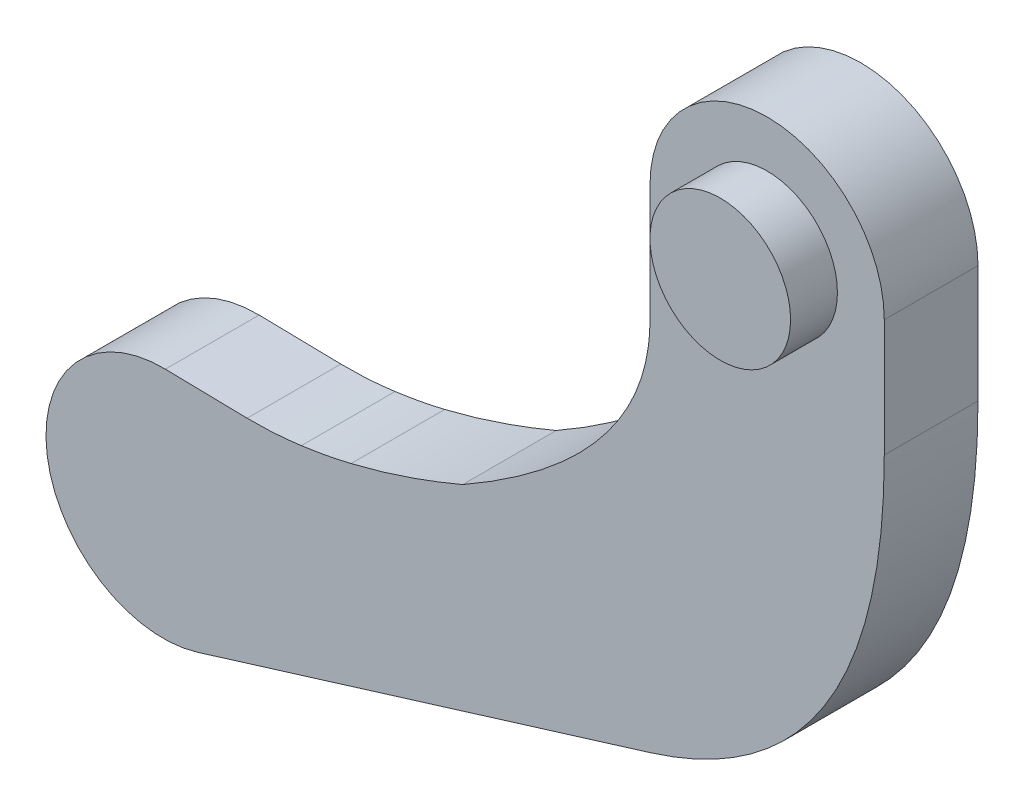
ISO-10303-21;
HEADER;
FILE_DESCRIPTION(('STEP AP214'),'2;1');
FILE_NAME('part.step','',(''),(''),'','','');
FILE_SCHEMA(('AUTOMOTIVE_DESIGN { 1 0 10303 214 1 1 1 1 }'));
ENDSEC;
DATA;
#1=APPLICATION_CONTEXT('core data for automotive mechanical design processes');
#2=APPLICATION_PROTOCOL_DEFINITION('international standard','automotive_design',2000,#1);
#3=PRODUCT_CONTEXT('',#1,'mechanical');
#4=PRODUCT('Part','Part','',(#3));
#5=PRODUCT_RELATED_PRODUCT_CATEGORY('part','',(#4));
#6=PRODUCT_DEFINITION_FORMATION('','',#4);
#7=PRODUCT_DEFINITION_CONTEXT('part definition',#1,'design');
#8=PRODUCT_DEFINITION('design','',#6,#7);
#9=PRODUCT_DEFINITION_SHAPE('','',#8);
#10=(LENGTH_UNIT() NAMED_UNIT(*) SI_UNIT(.MILLI.,.METRE.));
#11=(NAMED_UNIT(*) PLANE_ANGLE_UNIT() SI_UNIT($,.RADIAN.));
#12=(NAMED_UNIT(*) SI_UNIT($,.STERADIAN.) SOLID_ANGLE_UNIT());
#13=UNCERTAINTY_MEASURE_WITH_UNIT(LENGTH_MEASURE(1.E-05),#10,'distance_accuracy_value','');
#14=(GEOMETRIC_REPRESENTATION_CONTEXT(3) GLOBAL_UNCERTAINTY_ASSIGNED_CONTEXT((#13)) GLOBAL_UNIT_ASSIGNED_CONTEXT((#10,
#11,#12)) REPRESENTATION_CONTEXT('',''));
#15=CARTESIAN_POINT('',(0.,0.,0.));
#16=DIRECTION('',(0.,0.,1.));
#17=DIRECTION('',(1.,0.,0.));
#18=AXIS2_PLACEMENT_3D('',#15,#16,#17);
#19=CARTESIAN_POINT('',(-18.9450892189157,4.95826516691605,3.));
#20=DIRECTION('',(0.,0.,1.));
#21=DIRECTION('',(1.,0.,0.));
#22=AXIS2_PLACEMENT_3D('',#19,#20,#21);
#23=PLANE('',#22);
#24=CARTESIAN_POINT('',(-12.5,10.5,3.));
#25=DIRECTION('',(0.,0.,1.));
#26=DIRECTION('',(1.,0.,0.));
#27=AXIS2_PLACEMENT_3D('',#24,#25,#26);
#28=CIRCLE('',#27,1.5);
#29=CARTESIAN_POINT('',(-11.,10.5,3.));
#30=VERTEX_POINT('',#29);
#31=EDGE_CURVE('E11',#30,#30,#28,.T.);
#32=ORIENTED_EDGE('',*,*,#31,.T.);
#33=EDGE_LOOP('',(#32));
#34=FACE_BOUND('',#33,.T.);
#35=ADVANCED_FACE('F17',(#34),#23,.T.);
#36=CARTESIAN_POINT('',(-12.5,10.5,3.));
#37=DIRECTION('',(0.,0.,-1.));
#38=DIRECTION('',(-1.,0.,0.));
#39=AXIS2_PLACEMENT_3D('',#36,#37,#38);
#40=CYLINDRICAL_SURFACE('',#39,1.5);
#41=CARTESIAN_POINT('',(-12.5,10.5,2.));
#42=DIRECTION('',(0.,0.,1.));
#43=DIRECTION('',(1.,0.,0.));
#44=AXIS2_PLACEMENT_3D('',#41,#42,#43);
#45=CIRCLE('',#44,1.5);
#46=CARTESIAN_POINT('',(-11.,10.5,2.));
#47=VERTEX_POINT('',#46);
#48=EDGE_CURVE('E32',#47,#47,#45,.T.);
#49=ORIENTED_EDGE('',*,*,#48,.T.);
#50=EDGE_LOOP('',(#49));
#51=FACE_BOUND('',#50,.T.);
#52=ORIENTED_EDGE('',*,*,#31,.F.);
#53=EDGE_LOOP('',(#52));
#54=FACE_BOUND('',#53,.T.);
#55=ADVANCED_FACE('F428',(#51,#54),#40,.T.);
#56=CARTESIAN_POINT('',(-15.,4.95826516691604,0.));
#57=DIRECTION('',(0.,0.,1.));
#58=DIRECTION('',(1.,0.,0.));
#59=AXIS2_PLACEMENT_3D('',#56,#57,#58);
#60=PLANE('',#59);
#61=DIRECTION('',(0.999812744567832,-0.0193513772052415,0.));
#62=VECTOR('',#61,1.);
#63=CARTESIAN_POINT('',(-24.7776671423991,1.90514340302746,0.));
#64=LINE('',#63,#62);
#65=CARTESIAN_POINT('',(-25.3417999948184,1.91606219525165,0.));
#66=VERTEX_POINT('',#65);
#67=CARTESIAN_POINT('',(-23.5973931849003,1.88229919876904,0.));
#68=VERTEX_POINT('',#67);
#69=EDGE_CURVE('E154',#66,#68,#64,.T.);
#70=ORIENTED_EDGE('',*,*,#69,.T.);
#71=CARTESIAN_POINT('',(-23.5973931849003,1.88229919876904,0.));
#72=CARTESIAN_POINT('',(-23.0442076813498,1.87300791571998,0.));
#73=CARTESIAN_POINT('',(-22.4403096712738,1.95294060461028,0.));
#74=(BOUNDED_CURVE() B_SPLINE_CURVE(2,(#71,#72,#73),.UNSPECIFIED.,.F.,
.F.) B_SPLINE_CURVE_WITH_KNOTS((3,3),(0.,0.280041381433362),
.UNSPECIFIED.) CURVE() GEOMETRIC_REPRESENTATION_ITEM() RATIONAL_B_SPLINE_CURVE((1.,1.,1.)) REPRESENTATION_ITEM(''));
#75=CARTESIAN_POINT('',(-22.4403096712738,1.95294060461028,0.));
#76=VERTEX_POINT('',#75);
#77=EDGE_CURVE('E219',#68,#76,#74,.T.);
#78=ORIENTED_EDGE('',*,*,#77,.T.);
#79=CARTESIAN_POINT('',(-22.4403096712738,1.95294060461028,0.));
#80=CARTESIAN_POINT('',(-21.9283075673137,2.02070983750089,0.));
#81=CARTESIAN_POINT('',(-21.3798526232398,2.15261447615738,0.));
#82=(BOUNDED_CURVE() B_SPLINE_CURVE(2,(#79,#80,#81),.UNSPECIFIED.,.F.,
.F.) B_SPLINE_CURVE_WITH_KNOTS((3,3),(0.280041381433362,0.517468519952534),
.UNSPECIFIED.) CURVE() GEOMETRIC_REPRESENTATION_ITEM() RATIONAL_B_SPLINE_CURVE((1.,1.,1.)) REPRESENTATION_ITEM(''));
#83=CARTESIAN_POINT('',(-21.379852620456,2.15261447701456,0.));
#84=VERTEX_POINT('',#83);
#85=EDGE_CURVE('E201',#76,#84,#82,.T.);
#86=ORIENTED_EDGE('',*,*,#85,.T.);
#87=CARTESIAN_POINT('',(-21.3798526232398,2.15261447615738,0.));
#88=CARTESIAN_POINT('',(-20.2652084525949,2.4206888880086,0.));
#89=CARTESIAN_POINT('',(-19.,2.95366724936204,0.));
#90=(BOUNDED_CURVE() B_SPLINE_CURVE(2,(#87,#88,#89),.UNSPECIFIED.,.F.,
.F.) B_SPLINE_CURVE_WITH_KNOTS((3,3),(0.517468519952534,1.),
.UNSPECIFIED.) CURVE() GEOMETRIC_REPRESENTATION_ITEM() RATIONAL_B_SPLINE_CURVE((1.,1.,1.)) REPRESENTATION_ITEM(''));
#91=CARTESIAN_POINT('',(-19.,2.95366724936204,0.));
#92=VERTEX_POINT('',#91);
#93=EDGE_CURVE('E259',#84,#92,#90,.T.);
#94=ORIENTED_EDGE('',*,*,#93,.T.);
#95=CARTESIAN_POINT('',(-19.,2.95366724936204,0.));
#96=CARTESIAN_POINT('',(-15.,5.23166375318981,0.));
#97=CARTESIAN_POINT('',(-15.,8.,0.));
#98=(BOUNDED_CURVE() B_SPLINE_CURVE(2,(#95,#96,#97),.UNSPECIFIED.,.F.,
.F.) B_SPLINE_CURVE_WITH_KNOTS((3,3),(0.,1.),
.UNSPECIFIED.) CURVE() GEOMETRIC_REPRESENTATION_ITEM() RATIONAL_B_SPLINE_CURVE((1.,1.,1.)) REPRESENTATION_ITEM(''));
#99=CARTESIAN_POINT('',(-15.,8.,0.));
#100=VERTEX_POINT('',#99);
#101=EDGE_CURVE('E217',#92,#100,#98,.T.);
#102=ORIENTED_EDGE('',*,*,#101,.T.);
#103=DIRECTION('',(0.,-1.,0.));
#104=VECTOR('',#103,1.);
#105=CARTESIAN_POINT('',(-15.,8.17520207152069,0.));
#106=LINE('',#105,#104);
#107=CARTESIAN_POINT('',(-15.,10.5,0.));
#108=VERTEX_POINT('',#107);
#109=EDGE_CURVE('E195',#108,#100,#106,.T.);
#110=ORIENTED_EDGE('',*,*,#109,.F.);
#111=CARTESIAN_POINT('',(-12.5,10.5,0.));
#112=DIRECTION('',(0.,0.,-1.));
#113=DIRECTION('',(1.,0.,0.));
#114=AXIS2_PLACEMENT_3D('',#111,#112,#113);
#115=CIRCLE('',#114,2.5);
#116=CARTESIAN_POINT('',(-10.,10.5,0.));
#117=VERTEX_POINT('',#116);
#118=EDGE_CURVE('E248',#108,#117,#115,.T.);
#119=ORIENTED_EDGE('',*,*,#118,.T.);
#120=DIRECTION('',(0.,1.,0.));
#121=VECTOR('',#120,1.);
#122=CARTESIAN_POINT('',(-10.,9.25,0.));
#123=LINE('',#122,#121);
#124=CARTESIAN_POINT('',(-10.,8.,0.));
#125=VERTEX_POINT('',#124);
#126=EDGE_CURVE('E82',#125,#117,#123,.T.);
#127=ORIENTED_EDGE('',*,*,#126,.F.);
#128=CARTESIAN_POINT('',(-12.5000000096982,1.32400628140679,0.));
#129=CARTESIAN_POINT('',(-10.,3.43179298167471,0.));
#130=CARTESIAN_POINT('',(-10.,8.,0.));
#131=(BOUNDED_CURVE() B_SPLINE_CURVE(2,(#128,#129,#130),.UNSPECIFIED.,.F.,
.F.) B_SPLINE_CURVE_WITH_KNOTS((3,3),(0.292893217441925,1.),
.UNSPECIFIED.) CURVE() GEOMETRIC_REPRESENTATION_ITEM() RATIONAL_B_SPLINE_CURVE((1.,1.,1.)) REPRESENTATION_ITEM(''));
#132=CARTESIAN_POINT('',(-12.5000000096982,1.32400628140679,0.));
#133=VERTEX_POINT('',#132);
#134=EDGE_CURVE('E230',#133,#125,#131,.T.);
#135=ORIENTED_EDGE('',*,*,#134,.F.);
#136=CARTESIAN_POINT('',(-15.,0.,0.));
#137=CARTESIAN_POINT('',(-13.5355339127904,0.450932449347952,0.));
#138=CARTESIAN_POINT('',(-12.5000000096982,1.32400628140679,0.));
#139=(BOUNDED_CURVE() B_SPLINE_CURVE(2,(#136,#137,#138),.UNSPECIFIED.,.F.,
.F.) B_SPLINE_CURVE_WITH_KNOTS((3,3),(0.,0.292893217441925),
.UNSPECIFIED.) CURVE() GEOMETRIC_REPRESENTATION_ITEM() RATIONAL_B_SPLINE_CURVE((1.,1.,1.)) REPRESENTATION_ITEM(''));
#140=CARTESIAN_POINT('',(-15.,0.,0.));
#141=VERTEX_POINT('',#140);
#142=EDGE_CURVE('E214',#141,#133,#139,.T.);
#143=ORIENTED_EDGE('',*,*,#142,.F.);
#144=DIRECTION('',(-0.955718913883073,-0.294281086116928,0.));
#145=VECTOR('',#144,1.);
#146=CARTESIAN_POINT('',(-22.4382008114105,-2.29034058209032,0.));
#147=LINE('',#146,#145);
#148=CARTESIAN_POINT('',(-24.6544757225392,-2.97276695087561,0.));
#149=VERTEX_POINT('',#148);
#150=EDGE_CURVE('E156',#141,#149,#147,.T.);
#151=ORIENTED_EDGE('',*,*,#150,.T.);
#152=CARTESIAN_POINT('',(-25.3901784378315,-0.58346966616792,0.));
#153=DIRECTION('',(0.,0.,1.));
#154=DIRECTION('',(1.,0.,0.));
#155=AXIS2_PLACEMENT_3D('',#152,#153,#154);
#156=CIRCLE('',#155,2.5);
#157=EDGE_CURVE('E149',#66,#149,#156,.T.);
#158=ORIENTED_EDGE('',*,*,#157,.F.);
#159=EDGE_LOOP('',(#70,#78,#86,#94,#102,#110,#119,#127,#135,#143,#151,#158));
#160=FACE_BOUND('',#159,.T.);
#161=ADVANCED_FACE('F151',(#160),#60,.F.);
#162=CARTESIAN_POINT('',(-15.,4.95826516691604,2.));
#163=DIRECTION('',(0.,0.,1.));
#164=DIRECTION('',(1.,0.,0.));
#165=AXIS2_PLACEMENT_3D('',#162,#163,#164);
#166=PLANE('',#165);
#167=DIRECTION('',(0.999812744567832,-0.0193513772052415,0.));
#168=VECTOR('',#167,1.);
#169=CARTESIAN_POINT('',(-24.7776671423991,1.90514340302746,2.));
#170=LINE('',#169,#168);
#171=CARTESIAN_POINT('',(-25.3417999948184,1.91606219525165,2.));
#172=VERTEX_POINT('',#171);
#173=CARTESIAN_POINT('',(-23.5973931849003,1.88229919876904,2.));
#174=VERTEX_POINT('',#173);
#175=EDGE_CURVE('E173',#172,#174,#170,.T.);
#176=ORIENTED_EDGE('',*,*,#175,.F.);
#177=CARTESIAN_POINT('',(-25.3901784378315,-0.58346966616792,2.));
#178=DIRECTION('',(0.,0.,1.));
#179=DIRECTION('',(1.,0.,0.));
#180=AXIS2_PLACEMENT_3D('',#177,#178,#179);
#181=CIRCLE('',#180,2.5);
#182=CARTESIAN_POINT('',(-24.6544757225392,-2.97276695087561,2.));
#183=VERTEX_POINT('',#182);
#184=EDGE_CURVE('E168',#172,#183,#181,.T.);
#185=ORIENTED_EDGE('',*,*,#184,.T.);
#186=DIRECTION('',(-0.955718913883073,-0.294281086116928,0.));
#187=VECTOR('',#186,1.);
#188=CARTESIAN_POINT('',(-22.4382008114105,-2.29034058209032,2.));
#189=LINE('',#188,#187);
#190=CARTESIAN_POINT('',(-15.,0.,2.));
#191=VERTEX_POINT('',#190);
#192=EDGE_CURVE('E206',#191,#183,#189,.T.);
#193=ORIENTED_EDGE('',*,*,#192,.F.);
#194=CARTESIAN_POINT('',(-15.,0.,2.));
#195=CARTESIAN_POINT('',(-13.5355339127904,0.450932449347952,2.));
#196=CARTESIAN_POINT('',(-12.5000000096982,1.32400628140679,2.));
#197=(BOUNDED_CURVE() B_SPLINE_CURVE(2,(#194,#195,#196),.UNSPECIFIED.,.F.,
.F.) B_SPLINE_CURVE_WITH_KNOTS((3,3),(0.,0.292893217441925),
.UNSPECIFIED.) CURVE() GEOMETRIC_REPRESENTATION_ITEM() RATIONAL_B_SPLINE_CURVE((1.,1.,1.)) REPRESENTATION_ITEM(''));
#198=CARTESIAN_POINT('',(-12.5000000096982,1.32400628140679,2.));
#199=VERTEX_POINT('',#198);
#200=EDGE_CURVE('E213',#191,#199,#197,.T.);
#201=ORIENTED_EDGE('',*,*,#200,.T.);
#202=CARTESIAN_POINT('',(-12.5000000096982,1.32400628140679,2.));
#203=CARTESIAN_POINT('',(-10.,3.43179298167471,2.));
#204=CARTESIAN_POINT('',(-10.,8.,2.));
#205=(BOUNDED_CURVE() B_SPLINE_CURVE(2,(#202,#203,#204),.UNSPECIFIED.,.F.,
.F.) B_SPLINE_CURVE_WITH_KNOTS((3,3),(0.292893217441925,1.),
.UNSPECIFIED.) CURVE() GEOMETRIC_REPRESENTATION_ITEM() RATIONAL_B_SPLINE_CURVE((1.,1.,1.)) REPRESENTATION_ITEM(''));
#206=CARTESIAN_POINT('',(-10.,8.,2.));
#207=VERTEX_POINT('',#206);
#208=EDGE_CURVE('E23',#199,#207,#205,.T.);
#209=ORIENTED_EDGE('',*,*,#208,.T.);
#210=DIRECTION('',(0.,1.,0.));
#211=VECTOR('',#210,1.);
#212=CARTESIAN_POINT('',(-10.,9.25,2.));
#213=LINE('',#212,#211);
#214=CARTESIAN_POINT('',(-10.,10.5,2.));
#215=VERTEX_POINT('',#214);
#216=EDGE_CURVE('E254',#207,#215,#213,.T.);
#217=ORIENTED_EDGE('',*,*,#216,.T.);
#218=CARTESIAN_POINT('',(-12.5,10.5,2.));
#219=DIRECTION('',(0.,0.,-1.));
#220=DIRECTION('',(1.,0.,0.));
#221=AXIS2_PLACEMENT_3D('',#218,#219,#220);
#222=CIRCLE('',#221,2.5);
#223=CARTESIAN_POINT('',(-15.,10.5,2.));
#224=VERTEX_POINT('',#223);
#225=EDGE_CURVE('E258',#224,#215,#222,.T.);
#226=ORIENTED_EDGE('',*,*,#225,.F.);
#227=DIRECTION('',(0.,-1.,0.));
#228=VECTOR('',#227,1.);
#229=CARTESIAN_POINT('',(-15.,8.17520207152069,2.));
#230=LINE('',#229,#228);
#231=CARTESIAN_POINT('',(-15.,8.,2.));
#232=VERTEX_POINT('',#231);
#233=EDGE_CURVE('E194',#224,#232,#230,.T.);
#234=ORIENTED_EDGE('',*,*,#233,.T.);
#235=CARTESIAN_POINT('',(-19.,2.95366724936204,2.));
#236=CARTESIAN_POINT('',(-15.,5.23166375318981,2.));
#237=CARTESIAN_POINT('',(-15.,8.,2.));
#238=(BOUNDED_CURVE() B_SPLINE_CURVE(2,(#235,#236,#237),.UNSPECIFIED.,.F.,
.F.) B_SPLINE_CURVE_WITH_KNOTS((3,3),(0.,1.),
.UNSPECIFIED.) CURVE() GEOMETRIC_REPRESENTATION_ITEM() RATIONAL_B_SPLINE_CURVE((1.,1.,1.)) REPRESENTATION_ITEM(''));
#239=CARTESIAN_POINT('',(-19.,2.95366724936204,2.));
#240=VERTEX_POINT('',#239);
#241=EDGE_CURVE('E185',#240,#232,#238,.T.);
#242=ORIENTED_EDGE('',*,*,#241,.F.);
#243=CARTESIAN_POINT('',(-21.3798526232398,2.15261447615738,2.));
#244=CARTESIAN_POINT('',(-20.2652084525949,2.4206888880086,2.));
#245=CARTESIAN_POINT('',(-19.,2.95366724936204,2.));
#246=(BOUNDED_CURVE() B_SPLINE_CURVE(2,(#243,#244,#245),.UNSPECIFIED.,.F.,
.F.) B_SPLINE_CURVE_WITH_KNOTS((3,3),(0.517468519952534,1.),
.UNSPECIFIED.) CURVE() GEOMETRIC_REPRESENTATION_ITEM() RATIONAL_B_SPLINE_CURVE((1.,1.,1.)) REPRESENTATION_ITEM(''));
#247=CARTESIAN_POINT('',(-21.379852620456,2.15261447701456,2.));
#248=VERTEX_POINT('',#247);
#249=EDGE_CURVE('E287',#248,#240,#246,.T.);
#250=ORIENTED_EDGE('',*,*,#249,.F.);
#251=CARTESIAN_POINT('',(-22.4403096712738,1.95294060461028,2.));
#252=CARTESIAN_POINT('',(-21.9283075673137,2.02070983750089,2.));
#253=CARTESIAN_POINT('',(-21.3798526232398,2.15261447615738,2.));
#254=(BOUNDED_CURVE() B_SPLINE_CURVE(2,(#251,#252,#253),.UNSPECIFIED.,.F.,
.F.) B_SPLINE_CURVE_WITH_KNOTS((3,3),(0.280041381433362,0.517468519952534),
.UNSPECIFIED.) CURVE() GEOMETRIC_REPRESENTATION_ITEM() RATIONAL_B_SPLINE_CURVE((1.,1.,1.)) REPRESENTATION_ITEM(''));
#255=CARTESIAN_POINT('',(-22.4403096712738,1.95294060461028,2.));
#256=VERTEX_POINT('',#255);
#257=EDGE_CURVE('E200',#256,#248,#254,.T.);
#258=ORIENTED_EDGE('',*,*,#257,.F.);
#259=CARTESIAN_POINT('',(-23.5973931849003,1.88229919876904,2.));
#260=CARTESIAN_POINT('',(-23.0442076813498,1.87300791571998,2.));
#261=CARTESIAN_POINT('',(-22.4403096712738,1.95294060461028,2.));
#262=(BOUNDED_CURVE() B_SPLINE_CURVE(2,(#259,#260,#261),.UNSPECIFIED.,.F.,
.F.) B_SPLINE_CURVE_WITH_KNOTS((3,3),(0.,0.280041381433362),
.UNSPECIFIED.) CURVE() GEOMETRIC_REPRESENTATION_ITEM() RATIONAL_B_SPLINE_CURVE((1.,1.,1.)) REPRESENTATION_ITEM(''));
#263=EDGE_CURVE('E209',#174,#256,#262,.T.);
#264=ORIENTED_EDGE('',*,*,#263,.F.);
#265=EDGE_LOOP('',(#176,#185,#193,#201,#209,#217,#226,#234,#242,#250,#258,#264));
#266=FACE_BOUND('',#265,.T.);
#267=ORIENTED_EDGE('',*,*,#48,.F.);
#268=EDGE_LOOP('',(#267));
#269=FACE_BOUND('',#268,.T.);
#270=ADVANCED_FACE('F351',(#266,#269),#166,.T.);
#271=CARTESIAN_POINT('',(-23.5973931849003,1.88229919876904,2.));
#272=CARTESIAN_POINT('',(-23.5973931849003,1.88229919876904,0.));
#273=CARTESIAN_POINT('',(-23.2286028492,1.87610501006967,2.));
#274=CARTESIAN_POINT('',(-23.2286028492,1.87610501006967,0.));
#275=CARTESIAN_POINT('',(-22.8429083446578,1.89965214535008,2.));
#276=CARTESIAN_POINT('',(-22.8429083446578,1.89965214535008,0.));
#277=CARTESIAN_POINT('',(-22.4403096712738,1.95294060461028,2.));
#278=CARTESIAN_POINT('',(-22.4403096712738,1.95294060461028,0.));
#279=(BOUNDED_SURFACE() B_SPLINE_SURFACE(3,1,((#271,#272),(#273,#274),(#275,#276),(#277,#278)),
.UNSPECIFIED.,.F.,.F.,.F.) B_SPLINE_SURFACE_WITH_KNOTS((4,4),(2,2),(0.,0.280041381433362),(0.,
1.),.UNSPECIFIED.) GEOMETRIC_REPRESENTATION_ITEM() RATIONAL_B_SPLINE_SURFACE(((1.,1.),(1.,1.),
(1.,1.),(1.,1.))) REPRESENTATION_ITEM('') SURFACE());
#280=DIRECTION('',(0.,0.,-1.));
#281=VECTOR('',#280,1.);
#282=CARTESIAN_POINT('',(-23.5973931849003,1.88229919876904,2.));
#283=LINE('',#282,#281);
#284=EDGE_CURVE('E162',#174,#68,#283,.T.);
#285=DIRECTION('',(0.,0.,-1.));
#286=VECTOR('',#285,1.);
#287=CARTESIAN_POINT('',(-22.4403096712738,1.95294060461028,2.));
#288=LINE('',#287,#286);
#289=EDGE_CURVE('E196',#256,#76,#288,.T.);
#290=ORIENTED_EDGE('',*,*,#77,.F.);
#291=ORIENTED_EDGE('',*,*,#284,.F.);
#292=ORIENTED_EDGE('',*,*,#263,.T.);
#293=ORIENTED_EDGE('',*,*,#289,.T.);
#294=EDGE_LOOP('',(#290,#291,#292,#293));
#295=FACE_BOUND('',#294,.T.);
#296=ADVANCED_FACE('F349',(#295),#279,.T.);
#297=CARTESIAN_POINT('',(-22.4403096712738,1.95294060461028,2.));
#298=CARTESIAN_POINT('',(-22.4403096712738,1.95294060461028,0.));
#299=CARTESIAN_POINT('',(-22.0989749353004,1.99812009320402,2.));
#300=CARTESIAN_POINT('',(-22.0989749353004,1.99812009320402,0.));
#301=CARTESIAN_POINT('',(-21.7454892526224,2.06467805038639,2.));
#302=CARTESIAN_POINT('',(-21.7454892526224,2.06467805038639,0.));
#303=CARTESIAN_POINT('',(-21.3798526232398,2.15261447615738,2.));
#304=CARTESIAN_POINT('',(-21.3798526232398,2.15261447615738,0.));
#305=(BOUNDED_SURFACE() B_SPLINE_SURFACE(3,1,((#297,#298),(#299,#300),(#301,#302),(#303,#304)),
.UNSPECIFIED.,.F.,.F.,.F.) B_SPLINE_SURFACE_WITH_KNOTS((4,4),(2,2),(0.280041381433362,
0.517468519952534),(0.,1.),
.UNSPECIFIED.) GEOMETRIC_REPRESENTATION_ITEM() RATIONAL_B_SPLINE_SURFACE(((1.,1.),(1.,1.),(1.,
1.),(1.,1.))) REPRESENTATION_ITEM('') SURFACE());
#306=DIRECTION('',(0.,0.,-1.));
#307=VECTOR('',#306,1.);
#308=CARTESIAN_POINT('',(-21.379852620456,2.15261447701456,2.));
#309=LINE('',#308,#307);
#310=EDGE_CURVE('E264',#248,#84,#309,.T.);
#311=ORIENTED_EDGE('',*,*,#85,.F.);
#312=ORIENTED_EDGE('',*,*,#289,.F.);
#313=ORIENTED_EDGE('',*,*,#257,.T.);
#314=ORIENTED_EDGE('',*,*,#310,.T.);
#315=EDGE_LOOP('',(#311,#312,#313,#314));
#316=FACE_BOUND('',#315,.T.);
#317=ADVANCED_FACE('F339',(#316),#305,.T.);
#318=CARTESIAN_POINT('',(-21.3798526232398,2.15261447615738,2.));
#319=CARTESIAN_POINT('',(-21.3798526232398,2.15261447615738,0.));
#320=CARTESIAN_POINT('',(-20.6367565094766,2.33133075072486,2.));
#321=CARTESIAN_POINT('',(-20.6367565094766,2.33133075072486,0.));
#322=CARTESIAN_POINT('',(-19.8434723017299,2.59834834179308,2.));
#323=CARTESIAN_POINT('',(-19.8434723017299,2.59834834179308,0.));
#324=CARTESIAN_POINT('',(-19.,2.95366724936204,2.));
#325=CARTESIAN_POINT('',(-19.,2.95366724936204,0.));
#326=(BOUNDED_SURFACE() B_SPLINE_SURFACE(3,1,((#318,#319),(#320,#321),(#322,#323),(#324,#325)),
.UNSPECIFIED.,.F.,.F.,.F.) B_SPLINE_SURFACE_WITH_KNOTS((4,4),(2,2),(0.517468519952534,1.),(0.,
1.),.UNSPECIFIED.) GEOMETRIC_REPRESENTATION_ITEM() RATIONAL_B_SPLINE_SURFACE(((1.,1.),(1.,1.),
(1.,1.),(1.,1.))) REPRESENTATION_ITEM('') SURFACE());
#327=DIRECTION('',(0.,0.,-1.));
#328=VECTOR('',#327,1.);
#329=CARTESIAN_POINT('',(-19.,2.95366724936204,2.));
#330=LINE('',#329,#328);
#331=EDGE_CURVE('E246',#240,#92,#330,.T.);
#332=ORIENTED_EDGE('',*,*,#93,.F.);
#333=ORIENTED_EDGE('',*,*,#310,.F.);
#334=ORIENTED_EDGE('',*,*,#249,.T.);
#335=ORIENTED_EDGE('',*,*,#331,.T.);
#336=EDGE_LOOP('',(#332,#333,#334,#335));
#337=FACE_BOUND('',#336,.T.);
#338=ADVANCED_FACE('F345',(#337),#326,.T.);
#339=CARTESIAN_POINT('',(-19.,2.95366724936204,2.));
#340=CARTESIAN_POINT('',(-19.,2.95366724936204,0.));
#341=CARTESIAN_POINT('',(-16.3333333333333,4.47233158524722,2.));
#342=CARTESIAN_POINT('',(-16.3333333333333,4.47233158524722,0.));
#343=CARTESIAN_POINT('',(-15.,6.15444250212654,2.));
#344=CARTESIAN_POINT('',(-15.,6.15444250212654,0.));
#345=CARTESIAN_POINT('',(-15.,8.,2.));
#346=CARTESIAN_POINT('',(-15.,8.,0.));
#347=(BOUNDED_SURFACE() B_SPLINE_SURFACE(3,1,((#339,#340),(#341,#342),(#343,#344),(#345,#346)),
.UNSPECIFIED.,.F.,.F.,.F.) B_SPLINE_SURFACE_WITH_KNOTS((4,4),(2,2),(0.,1.),(0.,1.),
.UNSPECIFIED.) GEOMETRIC_REPRESENTATION_ITEM() RATIONAL_B_SPLINE_SURFACE(((1.,1.),(1.,1.),(1.,
1.),(1.,1.))) REPRESENTATION_ITEM('') SURFACE());
#348=DIRECTION('',(0.,0.,-1.));
#349=VECTOR('',#348,1.);
#350=CARTESIAN_POINT('',(-15.,8.,2.));
#351=LINE('',#350,#349);
#352=EDGE_CURVE('E190',#232,#100,#351,.T.);
#353=ORIENTED_EDGE('',*,*,#101,.F.);
#354=ORIENTED_EDGE('',*,*,#331,.F.);
#355=ORIENTED_EDGE('',*,*,#241,.T.);
#356=ORIENTED_EDGE('',*,*,#352,.T.);
#357=EDGE_LOOP('',(#353,#354,#355,#356));
#358=FACE_BOUND('',#357,.T.);
#359=ADVANCED_FACE('F19',(#358),#347,.T.);
#360=CARTESIAN_POINT('',(-15.,8.17520207152069,2.));
#361=DIRECTION('',(1.,0.,0.));
#362=DIRECTION('',(0.,1.,0.));
#363=AXIS2_PLACEMENT_3D('',#360,#361,#362);
#364=PLANE('',#363);
#365=ORIENTED_EDGE('',*,*,#109,.T.);
#366=ORIENTED_EDGE('',*,*,#352,.F.);
#367=ORIENTED_EDGE('',*,*,#233,.F.);
#368=DIRECTION('',(0.,0.,-1.));
#369=VECTOR('',#368,1.);
#370=CARTESIAN_POINT('',(-15.,10.5,2.));
#371=LINE('',#370,#369);
#372=EDGE_CURVE('E253',#224,#108,#371,.T.);
#373=ORIENTED_EDGE('',*,*,#372,.T.);
#374=EDGE_LOOP('',(#365,#366,#367,#373));
#375=FACE_BOUND('',#374,.T.);
#376=ADVANCED_FACE('F408',(#375),#364,.F.);
#377=CARTESIAN_POINT('',(-12.5,10.5,2.));
#378=DIRECTION('',(0.,0.,-1.));
#379=DIRECTION('',(-1.,0.,0.));
#380=AXIS2_PLACEMENT_3D('',#377,#378,#379);
#381=CYLINDRICAL_SURFACE('',#380,2.5);
#382=ORIENTED_EDGE('',*,*,#118,.F.);
#383=ORIENTED_EDGE('',*,*,#372,.F.);
#384=ORIENTED_EDGE('',*,*,#225,.T.);
#385=DIRECTION('',(0.,0.,-1.));
#386=VECTOR('',#385,1.);
#387=CARTESIAN_POINT('',(-10.,10.5,2.));
#388=LINE('',#387,#386);
#389=EDGE_CURVE('E272',#215,#117,#388,.T.);
#390=ORIENTED_EDGE('',*,*,#389,.T.);
#391=EDGE_LOOP('',(#382,#383,#384,#390));
#392=FACE_BOUND('',#391,.T.);
#393=ADVANCED_FACE('F413',(#392),#381,.T.);
#394=CARTESIAN_POINT('',(-10.,9.25,2.));
#395=DIRECTION('',(-1.,0.,0.));
#396=DIRECTION('',(0.,0.,1.));
#397=AXIS2_PLACEMENT_3D('',#394,#395,#396);
#398=PLANE('',#397);
#399=ORIENTED_EDGE('',*,*,#126,.T.);
#400=ORIENTED_EDGE('',*,*,#389,.F.);
#401=ORIENTED_EDGE('',*,*,#216,.F.);
#402=DIRECTION('',(0.,0.,-1.));
#403=VECTOR('',#402,1.);
#404=CARTESIAN_POINT('',(-10.,8.,2.));
#405=LINE('',#404,#403);
#406=EDGE_CURVE('E228',#207,#125,#405,.T.);
#407=ORIENTED_EDGE('',*,*,#406,.T.);
#408=EDGE_LOOP('',(#399,#400,#401,#407));
#409=FACE_BOUND('',#408,.T.);
#410=ADVANCED_FACE('F414',(#409),#398,.F.);
#411=CARTESIAN_POINT('',(-12.5000000096982,1.32400628140679,2.));
#412=CARTESIAN_POINT('',(-12.5000000096982,1.32400628140679,0.));
#413=CARTESIAN_POINT('',(-10.8333333365661,2.72919741491874,2.));
#414=CARTESIAN_POINT('',(-10.8333333365661,2.72919741491874,0.));
#415=CARTESIAN_POINT('',(-10.,4.95452865444981,2.));
#416=CARTESIAN_POINT('',(-10.,4.95452865444981,0.));
#417=CARTESIAN_POINT('',(-10.,8.,2.));
#418=CARTESIAN_POINT('',(-10.,8.,0.));
#419=(BOUNDED_SURFACE() B_SPLINE_SURFACE(3,1,((#411,#412),(#413,#414),(#415,#416),(#417,#418)),
.UNSPECIFIED.,.F.,.F.,.F.) B_SPLINE_SURFACE_WITH_KNOTS((4,4),(2,2),(0.292893217441925,1.),(0.,
1.),.UNSPECIFIED.) GEOMETRIC_REPRESENTATION_ITEM() RATIONAL_B_SPLINE_SURFACE(((1.,1.),(1.,1.),
(1.,1.),(1.,1.))) REPRESENTATION_ITEM('') SURFACE());
#420=DIRECTION('',(0.,0.,-1.));
#421=VECTOR('',#420,1.);
#422=CARTESIAN_POINT('',(-12.5000000096982,1.32400628140679,2.));
#423=LINE('',#422,#421);
#424=EDGE_CURVE('E210',#199,#133,#423,.T.);
#425=ORIENTED_EDGE('',*,*,#134,.T.);
#426=ORIENTED_EDGE('',*,*,#406,.F.);
#427=ORIENTED_EDGE('',*,*,#208,.F.);
#428=ORIENTED_EDGE('',*,*,#424,.T.);
#429=EDGE_LOOP('',(#425,#426,#427,#428));
#430=FACE_BOUND('',#429,.T.);
#431=ADVANCED_FACE('F416',(#430),#419,.F.);
#432=CARTESIAN_POINT('',(-15.,0.,2.));
#433=CARTESIAN_POINT('',(-15.,0.,0.));
#434=CARTESIAN_POINT('',(-14.0236892751936,0.300621632898634,2.));
#435=CARTESIAN_POINT('',(-14.0236892751936,0.300621632898634,0.));
#436=CARTESIAN_POINT('',(-13.190355945093,0.74195706003423,2.));
#437=CARTESIAN_POINT('',(-13.190355945093,0.74195706003423,0.));
#438=CARTESIAN_POINT('',(-12.5000000096982,1.32400628140679,2.));
#439=CARTESIAN_POINT('',(-12.5000000096982,1.32400628140679,0.));
#440=(BOUNDED_SURFACE() B_SPLINE_SURFACE(3,1,((#432,#433),(#434,#435),(#436,#437),(#438,#439)),
.UNSPECIFIED.,.F.,.F.,.F.) B_SPLINE_SURFACE_WITH_KNOTS((4,4),(2,2),(0.,0.292893217441925),(0.,
1.),.UNSPECIFIED.) GEOMETRIC_REPRESENTATION_ITEM() RATIONAL_B_SPLINE_SURFACE(((1.,1.),(1.,1.),
(1.,1.),(1.,1.))) REPRESENTATION_ITEM('') SURFACE());
#441=DIRECTION('',(0.,0.,-1.));
#442=VECTOR('',#441,1.);
#443=CARTESIAN_POINT('',(-15.,0.,2.));
#444=LINE('',#443,#442);
#445=EDGE_CURVE('E202',#191,#141,#444,.T.);
#446=ORIENTED_EDGE('',*,*,#142,.T.);
#447=ORIENTED_EDGE('',*,*,#424,.F.);
#448=ORIENTED_EDGE('',*,*,#200,.F.);
#449=ORIENTED_EDGE('',*,*,#445,.T.);
#450=EDGE_LOOP('',(#446,#447,#448,#449));
#451=FACE_BOUND('',#450,.T.);
#452=ADVANCED_FACE('F422',(#451),#440,.F.);
#453=CARTESIAN_POINT('',(-22.4382008114105,-2.29034058209032,2.));
#454=DIRECTION('',(0.294281086116928,-0.955718913883073,0.));
#455=DIRECTION('',(0.,0.,-1.));
#456=AXIS2_PLACEMENT_3D('',#453,#454,#455);
#457=PLANE('',#456);
#458=ORIENTED_EDGE('',*,*,#150,.F.);
#459=ORIENTED_EDGE('',*,*,#445,.F.);
#460=ORIENTED_EDGE('',*,*,#192,.T.);
#461=DIRECTION('',(0.,0.,-1.));
#462=VECTOR('',#461,1.);
#463=CARTESIAN_POINT('',(-24.6544757225392,-2.97276695087561,2.));
#464=LINE('',#463,#462);
#465=EDGE_CURVE('E161',#183,#149,#464,.T.);
#466=ORIENTED_EDGE('',*,*,#465,.T.);
#467=EDGE_LOOP('',(#458,#459,#460,#466));
#468=FACE_BOUND('',#467,.T.);
#469=ADVANCED_FACE('F466',(#468),#457,.T.);
#470=CARTESIAN_POINT('',(-25.3901784378315,-0.58346966616792,2.));
#471=DIRECTION('',(0.,0.,-1.));
#472=DIRECTION('',(-1.,0.,0.));
#473=AXIS2_PLACEMENT_3D('',#470,#471,#472);
#474=CYLINDRICAL_SURFACE('',#473,2.5);
#475=ORIENTED_EDGE('',*,*,#157,.T.);
#476=ORIENTED_EDGE('',*,*,#465,.F.);
#477=ORIENTED_EDGE('',*,*,#184,.F.);
#478=DIRECTION('',(0.,0.,-1.));
#479=VECTOR('',#478,1.);
#480=CARTESIAN_POINT('',(-25.3417999948184,1.91606219525165,2.));
#481=LINE('',#480,#479);
#482=EDGE_CURVE('E165',#172,#66,#481,.T.);
#483=ORIENTED_EDGE('',*,*,#482,.T.);
#484=EDGE_LOOP('',(#475,#476,#477,#483));
#485=FACE_BOUND('',#484,.T.);
#486=ADVANCED_FACE('F166',(#485),#474,.T.);
#487=CARTESIAN_POINT('',(-24.7776671423991,1.90514340302746,2.));
#488=DIRECTION('',(0.0193513772052415,0.999812744567832,0.));
#489=DIRECTION('',(0.,0.,-1.));
#490=AXIS2_PLACEMENT_3D('',#487,#488,#489);
#491=PLANE('',#490);
#492=ORIENTED_EDGE('',*,*,#69,.F.);
#493=ORIENTED_EDGE('',*,*,#482,.F.);
#494=ORIENTED_EDGE('',*,*,#175,.T.);
#495=ORIENTED_EDGE('',*,*,#284,.T.);
#496=EDGE_LOOP('',(#492,#493,#494,#495));
#497=FACE_BOUND('',#496,.T.);
#498=ADVANCED_FACE('F176',(#497),#491,.T.);
#499=CLOSED_SHELL('',(#35,#55,#161,#270,#296,#317,#338,#359,#376,#393,#410,#431,#452,#469,#486,#498));
#500=MANIFOLD_SOLID_BREP('B1',#499);
#501=ADVANCED_BREP_SHAPE_REPRESENTATION('',(#18,#500),#14);
#502=SHAPE_DEFINITION_REPRESENTATION(#9,#501);
ENDSEC;
END-ISO-10303-21;
